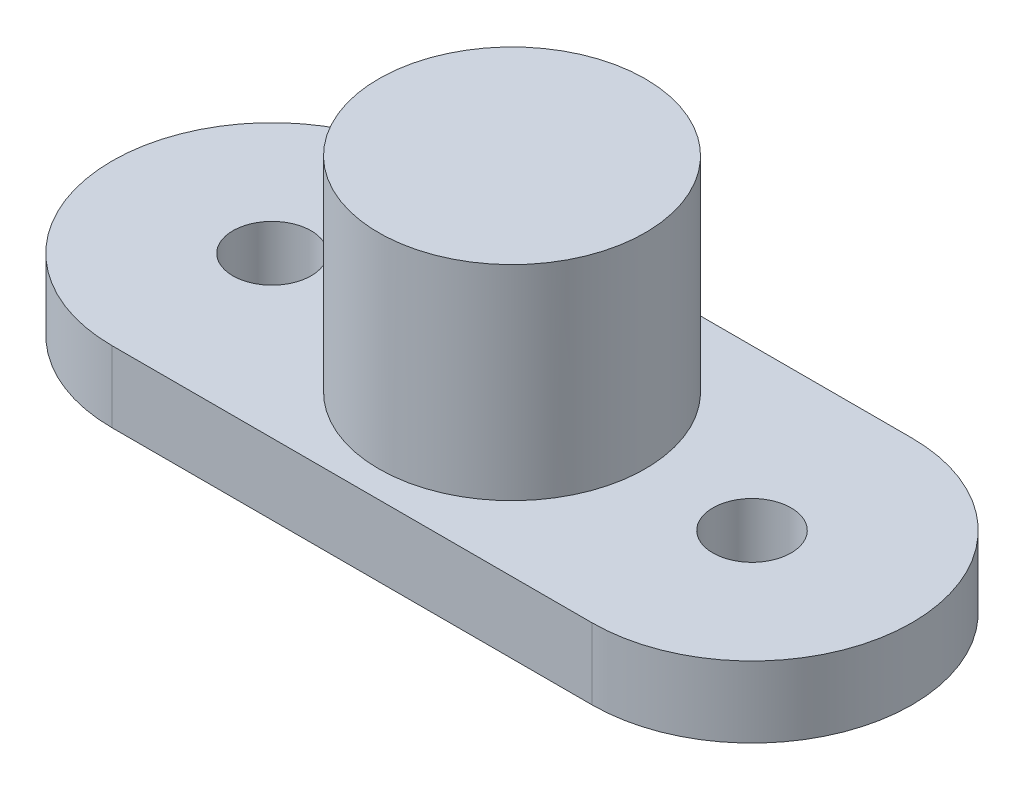
ISO-10303-21;
HEADER;
FILE_DESCRIPTION(('STEP AP214'),'2;1');
FILE_NAME('part.step','',(''),(''),'','','');
FILE_SCHEMA(('AUTOMOTIVE_DESIGN { 1 0 10303 214 1 1 1 1 }'));
ENDSEC;
DATA;
#1=APPLICATION_CONTEXT('core data for automotive mechanical design processes');
#2=APPLICATION_PROTOCOL_DEFINITION('international standard','automotive_design',2000,#1);
#3=PRODUCT_CONTEXT('',#1,'mechanical');
#4=PRODUCT('Part','Part','',(#3));
#5=PRODUCT_RELATED_PRODUCT_CATEGORY('part','',(#4));
#6=PRODUCT_DEFINITION_FORMATION('','',#4);
#7=PRODUCT_DEFINITION_CONTEXT('part definition',#1,'design');
#8=PRODUCT_DEFINITION('design','',#6,#7);
#9=PRODUCT_DEFINITION_SHAPE('','',#8);
#10=(LENGTH_UNIT() NAMED_UNIT(*) SI_UNIT(.MILLI.,.METRE.));
#11=(NAMED_UNIT(*) PLANE_ANGLE_UNIT() SI_UNIT($,.RADIAN.));
#12=(NAMED_UNIT(*) SI_UNIT($,.STERADIAN.) SOLID_ANGLE_UNIT());
#13=UNCERTAINTY_MEASURE_WITH_UNIT(LENGTH_MEASURE(1.E-05),#10,'distance_accuracy_value','');
#14=(GEOMETRIC_REPRESENTATION_CONTEXT(3) GLOBAL_UNCERTAINTY_ASSIGNED_CONTEXT((#13)) GLOBAL_UNIT_ASSIGNED_CONTEXT((#10,
#11,#12)) REPRESENTATION_CONTEXT('',''));
#15=CARTESIAN_POINT('',(0.,0.,0.));
#16=DIRECTION('',(0.,0.,1.));
#17=DIRECTION('',(1.,0.,0.));
#18=AXIS2_PLACEMENT_3D('',#15,#16,#17);
#19=CARTESIAN_POINT('',(0.,2.,-4.49950296687665));
#20=DIRECTION('',(0.,0.,-1.));
#21=DIRECTION('',(-1.,0.,0.));
#22=AXIS2_PLACEMENT_3D('',#19,#20,#21);
#23=PLANE('',#22);
#24=DIRECTION('',(1.,0.,0.));
#25=VECTOR('',#24,1.);
#26=CARTESIAN_POINT('',(0.,0.,-4.49950296687665));
#27=LINE('',#26,#25);
#28=CARTESIAN_POINT('',(-6.75,0.,-4.49950296687665));
#29=VERTEX_POINT('',#28);
#30=CARTESIAN_POINT('',(6.75,0.,-4.49950296687665));
#31=VERTEX_POINT('',#30);
#32=EDGE_CURVE('E119',#29,#31,#27,.T.);
#33=ORIENTED_EDGE('',*,*,#32,.F.);
#34=DIRECTION('',(0.,-1.,0.));
#35=VECTOR('',#34,1.);
#36=CARTESIAN_POINT('',(-6.75,2.,-4.49950296687665));
#37=LINE('',#36,#35);
#38=CARTESIAN_POINT('',(-6.75,2.,-4.49950296687665));
#39=VERTEX_POINT('',#38);
#40=EDGE_CURVE('E11',#39,#29,#37,.T.);
#41=ORIENTED_EDGE('',*,*,#40,.F.);
#42=DIRECTION('',(1.,0.,0.));
#43=VECTOR('',#42,1.);
#44=CARTESIAN_POINT('',(0.,2.,-4.49950296687665));
#45=LINE('',#44,#43);
#46=CARTESIAN_POINT('',(6.75,2.,-4.49950296687665));
#47=VERTEX_POINT('',#46);
#48=EDGE_CURVE('E96',#39,#47,#45,.T.);
#49=ORIENTED_EDGE('',*,*,#48,.T.);
#50=DIRECTION('',(0.,-1.,0.));
#51=VECTOR('',#50,1.);
#52=CARTESIAN_POINT('',(6.75,2.,-4.49950296687665));
#53=LINE('',#52,#51);
#54=EDGE_CURVE('E57',#47,#31,#53,.T.);
#55=ORIENTED_EDGE('',*,*,#54,.T.);
#56=EDGE_LOOP('',(#33,#41,#49,#55));
#57=FACE_BOUND('',#56,.T.);
#58=ADVANCED_FACE('F39',(#57),#23,.T.);
#59=CARTESIAN_POINT('',(-6.75,2.,0.));
#60=DIRECTION('',(0.,-1.,0.));
#61=DIRECTION('',(0.,0.,-1.));
#62=AXIS2_PLACEMENT_3D('',#59,#60,#61);
#63=CYLINDRICAL_SURFACE('',#62,4.49950296687665);
#64=CARTESIAN_POINT('',(-6.75,0.,0.));
#65=DIRECTION('',(0.,1.,0.));
#66=DIRECTION('',(0.,0.,1.));
#67=AXIS2_PLACEMENT_3D('',#64,#65,#66);
#68=CIRCLE('',#67,4.49950296687665);
#69=CARTESIAN_POINT('',(-6.75,0.,4.49950296687665));
#70=VERTEX_POINT('',#69);
#71=EDGE_CURVE('E102',#29,#70,#68,.T.);
#72=ORIENTED_EDGE('',*,*,#71,.T.);
#73=DIRECTION('',(0.,-1.,0.));
#74=VECTOR('',#73,1.);
#75=CARTESIAN_POINT('',(-6.75,2.,4.49950296687665));
#76=LINE('',#75,#74);
#77=CARTESIAN_POINT('',(-6.75,2.,4.49950296687665));
#78=VERTEX_POINT('',#77);
#79=EDGE_CURVE('E49',#78,#70,#76,.T.);
#80=ORIENTED_EDGE('',*,*,#79,.F.);
#81=CARTESIAN_POINT('',(-6.75,2.,0.));
#82=DIRECTION('',(0.,1.,0.));
#83=DIRECTION('',(0.,0.,1.));
#84=AXIS2_PLACEMENT_3D('',#81,#82,#83);
#85=CIRCLE('',#84,4.49950296687665);
#86=EDGE_CURVE('E92',#39,#78,#85,.T.);
#87=ORIENTED_EDGE('',*,*,#86,.F.);
#88=ORIENTED_EDGE('',*,*,#40,.T.);
#89=EDGE_LOOP('',(#72,#80,#87,#88));
#90=FACE_BOUND('',#89,.T.);
#91=ADVANCED_FACE('F100',(#90),#63,.T.);
#92=CARTESIAN_POINT('',(0.,2.,4.49950296687665));
#93=DIRECTION('',(0.,0.,-1.));
#94=DIRECTION('',(-1.,0.,0.));
#95=AXIS2_PLACEMENT_3D('',#92,#93,#94);
#96=PLANE('',#95);
#97=DIRECTION('',(1.,0.,0.));
#98=VECTOR('',#97,1.);
#99=CARTESIAN_POINT('',(0.,0.,4.49950296687665));
#100=LINE('',#99,#98);
#101=CARTESIAN_POINT('',(6.75,0.,4.49950296687665));
#102=VERTEX_POINT('',#101);
#103=EDGE_CURVE('E114',#70,#102,#100,.T.);
#104=ORIENTED_EDGE('',*,*,#103,.T.);
#105=DIRECTION('',(0.,-1.,0.));
#106=VECTOR('',#105,1.);
#107=CARTESIAN_POINT('',(6.75,2.,4.49950296687665));
#108=LINE('',#107,#106);
#109=CARTESIAN_POINT('',(6.75,2.,4.49950296687665));
#110=VERTEX_POINT('',#109);
#111=EDGE_CURVE('E71',#110,#102,#108,.T.);
#112=ORIENTED_EDGE('',*,*,#111,.F.);
#113=DIRECTION('',(1.,0.,0.));
#114=VECTOR('',#113,1.);
#115=CARTESIAN_POINT('',(0.,2.,4.49950296687665));
#116=LINE('',#115,#114);
#117=EDGE_CURVE('E83',#78,#110,#116,.T.);
#118=ORIENTED_EDGE('',*,*,#117,.F.);
#119=ORIENTED_EDGE('',*,*,#79,.T.);
#120=EDGE_LOOP('',(#104,#112,#118,#119));
#121=FACE_BOUND('',#120,.T.);
#122=ADVANCED_FACE('F85',(#121),#96,.F.);
#123=CARTESIAN_POINT('',(-6.75,2.,0.));
#124=DIRECTION('',(0.,-1.,0.));
#125=DIRECTION('',(0.,0.,-1.));
#126=AXIS2_PLACEMENT_3D('',#123,#124,#125);
#127=CYLINDRICAL_SURFACE('',#126,1.1);
#128=CARTESIAN_POINT('',(-6.75,2.,0.));
#129=DIRECTION('',(0.,1.,0.));
#130=DIRECTION('',(0.,0.,1.));
#131=AXIS2_PLACEMENT_3D('',#128,#129,#130);
#132=CIRCLE('',#131,1.1);
#133=CARTESIAN_POINT('',(-6.75,2.,1.1));
#134=VERTEX_POINT('',#133);
#135=EDGE_CURVE('E139',#134,#134,#132,.T.);
#136=ORIENTED_EDGE('',*,*,#135,.T.);
#137=EDGE_LOOP('',(#136));
#138=FACE_BOUND('',#137,.T.);
#139=CARTESIAN_POINT('',(-6.75,0.,0.));
#140=DIRECTION('',(0.,1.,0.));
#141=DIRECTION('',(0.,0.,1.));
#142=AXIS2_PLACEMENT_3D('',#139,#140,#141);
#143=CIRCLE('',#142,1.1);
#144=CARTESIAN_POINT('',(-6.75,0.,1.1));
#145=VERTEX_POINT('',#144);
#146=EDGE_CURVE('E122',#145,#145,#143,.T.);
#147=ORIENTED_EDGE('',*,*,#146,.F.);
#148=EDGE_LOOP('',(#147));
#149=FACE_BOUND('',#148,.T.);
#150=ADVANCED_FACE('F168',(#138,#149),#127,.F.);
#151=CARTESIAN_POINT('',(6.75,2.,0.));
#152=DIRECTION('',(0.,-1.,0.));
#153=DIRECTION('',(0.,0.,-1.));
#154=AXIS2_PLACEMENT_3D('',#151,#152,#153);
#155=CYLINDRICAL_SURFACE('',#154,1.1);
#156=CARTESIAN_POINT('',(6.75,2.,0.));
#157=DIRECTION('',(0.,1.,0.));
#158=DIRECTION('',(0.,0.,1.));
#159=AXIS2_PLACEMENT_3D('',#156,#157,#158);
#160=CIRCLE('',#159,1.1);
#161=CARTESIAN_POINT('',(6.75,2.,1.1));
#162=VERTEX_POINT('',#161);
#163=EDGE_CURVE('E113',#162,#162,#160,.T.);
#164=ORIENTED_EDGE('',*,*,#163,.T.);
#165=EDGE_LOOP('',(#164));
#166=FACE_BOUND('',#165,.T.);
#167=CARTESIAN_POINT('',(6.75,0.,0.));
#168=DIRECTION('',(0.,1.,0.));
#169=DIRECTION('',(0.,0.,1.));
#170=AXIS2_PLACEMENT_3D('',#167,#168,#169);
#171=CIRCLE('',#170,1.1);
#172=CARTESIAN_POINT('',(6.75,0.,1.1));
#173=VERTEX_POINT('',#172);
#174=EDGE_CURVE('E126',#173,#173,#171,.T.);
#175=ORIENTED_EDGE('',*,*,#174,.F.);
#176=EDGE_LOOP('',(#175));
#177=FACE_BOUND('',#176,.T.);
#178=ADVANCED_FACE('F41',(#166,#177),#155,.F.);
#179=CARTESIAN_POINT('',(6.75,2.,0.));
#180=DIRECTION('',(0.,-1.,0.));
#181=DIRECTION('',(0.,0.,-1.));
#182=AXIS2_PLACEMENT_3D('',#179,#180,#181);
#183=CYLINDRICAL_SURFACE('',#182,4.49950296687665);
#184=CARTESIAN_POINT('',(6.75,0.,0.));
#185=DIRECTION('',(0.,1.,0.));
#186=DIRECTION('',(0.,0.,1.));
#187=AXIS2_PLACEMENT_3D('',#184,#185,#186);
#188=CIRCLE('',#187,4.49950296687665);
#189=EDGE_CURVE('E109',#31,#102,#188,.F.);
#190=ORIENTED_EDGE('',*,*,#189,.F.);
#191=ORIENTED_EDGE('',*,*,#54,.F.);
#192=CARTESIAN_POINT('',(6.75,2.,0.));
#193=DIRECTION('',(0.,1.,0.));
#194=DIRECTION('',(0.,0.,1.));
#195=AXIS2_PLACEMENT_3D('',#192,#193,#194);
#196=CIRCLE('',#195,4.49950296687665);
#197=EDGE_CURVE('E91',#47,#110,#196,.F.);
#198=ORIENTED_EDGE('',*,*,#197,.T.);
#199=ORIENTED_EDGE('',*,*,#111,.T.);
#200=EDGE_LOOP('',(#190,#191,#198,#199));
#201=FACE_BOUND('',#200,.T.);
#202=ADVANCED_FACE('F175',(#201),#183,.T.);
#203=CARTESIAN_POINT('',(0.,2.,0.));
#204=DIRECTION('',(0.,1.,0.));
#205=DIRECTION('',(0.,0.,1.));
#206=AXIS2_PLACEMENT_3D('',#203,#204,#205);
#207=PLANE('',#206);
#208=ORIENTED_EDGE('',*,*,#163,.F.);
#209=EDGE_LOOP('',(#208));
#210=FACE_BOUND('',#209,.T.);
#211=ORIENTED_EDGE('',*,*,#135,.F.);
#212=EDGE_LOOP('',(#211));
#213=FACE_BOUND('',#212,.T.);
#214=CARTESIAN_POINT('',(0.,2.,0.));
#215=DIRECTION('',(0.,1.,0.));
#216=DIRECTION('',(0.,0.,1.));
#217=AXIS2_PLACEMENT_3D('',#214,#215,#216);
#218=CIRCLE('',#217,3.75);
#219=CARTESIAN_POINT('',(0.,2.,3.75));
#220=VERTEX_POINT('',#219);
#221=EDGE_CURVE('E135',#220,#220,#218,.T.);
#222=ORIENTED_EDGE('',*,*,#221,.F.);
#223=EDGE_LOOP('',(#222));
#224=FACE_BOUND('',#223,.T.);
#225=ORIENTED_EDGE('',*,*,#48,.F.);
#226=ORIENTED_EDGE('',*,*,#86,.T.);
#227=ORIENTED_EDGE('',*,*,#117,.T.);
#228=ORIENTED_EDGE('',*,*,#197,.F.);
#229=EDGE_LOOP('',(#225,#226,#227,#228));
#230=FACE_BOUND('',#229,.T.);
#231=ADVANCED_FACE('F95',(#210,#213,#224,#230),#207,.T.);
#232=CARTESIAN_POINT('',(0.,0.,0.));
#233=DIRECTION('',(0.,1.,0.));
#234=DIRECTION('',(0.,0.,1.));
#235=AXIS2_PLACEMENT_3D('',#232,#233,#234);
#236=PLANE('',#235);
#237=ORIENTED_EDGE('',*,*,#174,.T.);
#238=EDGE_LOOP('',(#237));
#239=FACE_BOUND('',#238,.T.);
#240=ORIENTED_EDGE('',*,*,#146,.T.);
#241=EDGE_LOOP('',(#240));
#242=FACE_BOUND('',#241,.T.);
#243=ORIENTED_EDGE('',*,*,#32,.T.);
#244=ORIENTED_EDGE('',*,*,#189,.T.);
#245=ORIENTED_EDGE('',*,*,#103,.F.);
#246=ORIENTED_EDGE('',*,*,#71,.F.);
#247=EDGE_LOOP('',(#243,#244,#245,#246));
#248=FACE_BOUND('',#247,.T.);
#249=ADVANCED_FACE('F158',(#239,#242,#248),#236,.F.);
#250=CARTESIAN_POINT('',(0.,7.75,0.));
#251=DIRECTION('',(0.,-1.,0.));
#252=DIRECTION('',(0.,0.,-1.));
#253=AXIS2_PLACEMENT_3D('',#250,#251,#252);
#254=CYLINDRICAL_SURFACE('',#253,3.75);
#255=ORIENTED_EDGE('',*,*,#221,.T.);
#256=EDGE_LOOP('',(#255));
#257=FACE_BOUND('',#256,.T.);
#258=CARTESIAN_POINT('',(0.,7.75,0.));
#259=DIRECTION('',(0.,-1.,0.));
#260=DIRECTION('',(0.,0.,-1.));
#261=AXIS2_PLACEMENT_3D('',#258,#259,#260);
#262=CIRCLE('',#261,3.75);
#263=CARTESIAN_POINT('',(0.,7.75,-3.75));
#264=VERTEX_POINT('',#263);
#265=EDGE_CURVE('E130',#264,#264,#262,.T.);
#266=ORIENTED_EDGE('',*,*,#265,.T.);
#267=EDGE_LOOP('',(#266));
#268=FACE_BOUND('',#267,.T.);
#269=ADVANCED_FACE('F150',(#257,#268),#254,.T.);
#270=CARTESIAN_POINT('',(0.,7.75,0.));
#271=DIRECTION('',(0.,-1.,0.));
#272=DIRECTION('',(0.,0.,-1.));
#273=AXIS2_PLACEMENT_3D('',#270,#271,#272);
#274=PLANE('',#273);
#275=ORIENTED_EDGE('',*,*,#265,.F.);
#276=EDGE_LOOP('',(#275));
#277=FACE_BOUND('',#276,.T.);
#278=ADVANCED_FACE('F152',(#277),#274,.F.);
#279=CLOSED_SHELL('',(#58,#91,#122,#150,#178,#202,#231,#249,#269,#278));
#280=MANIFOLD_SOLID_BREP('B2',#279);
#281=ADVANCED_BREP_SHAPE_REPRESENTATION('',(#18,#280),#14);
#282=SHAPE_DEFINITION_REPRESENTATION(#9,#281);
ENDSEC;
END-ISO-10303-21;
